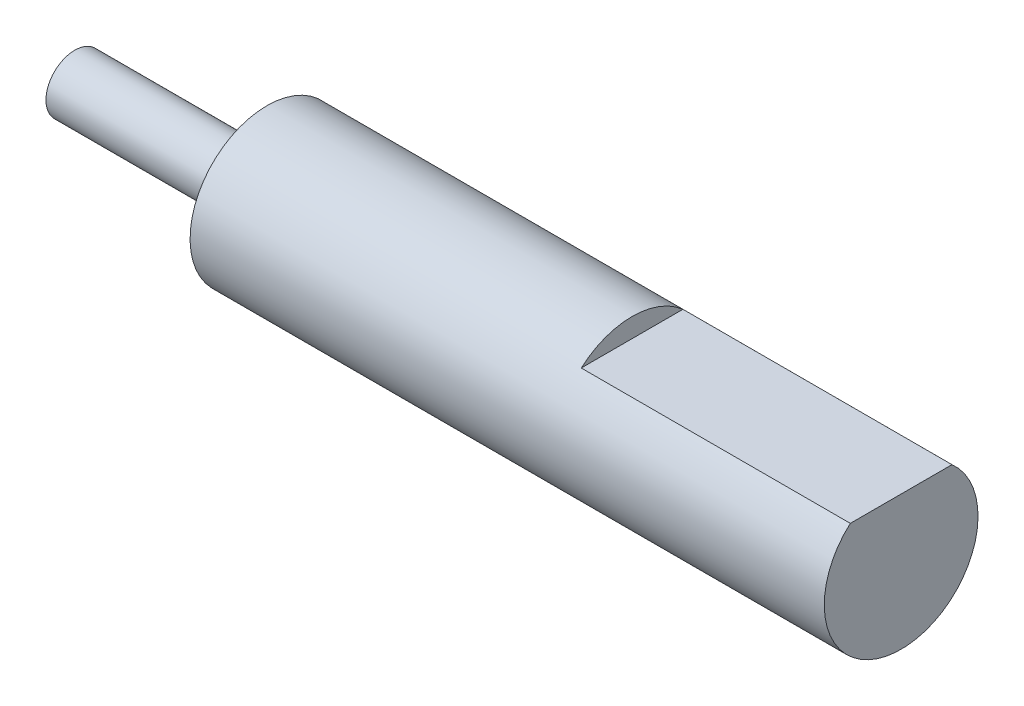
ISO-10303-21;
HEADER;
FILE_DESCRIPTION(('STEP AP214'),'2;1');
FILE_NAME('part.step','',(''),(''),'','','');
FILE_SCHEMA(('AUTOMOTIVE_DESIGN { 1 0 10303 214 1 1 1 1 }'));
ENDSEC;
DATA;
#1=APPLICATION_CONTEXT('core data for automotive mechanical design processes');
#2=APPLICATION_PROTOCOL_DEFINITION('international standard','automotive_design',2000,#1);
#3=PRODUCT_CONTEXT('',#1,'mechanical');
#4=PRODUCT('Part','Part','',(#3));
#5=PRODUCT_RELATED_PRODUCT_CATEGORY('part','',(#4));
#6=PRODUCT_DEFINITION_FORMATION('','',#4);
#7=PRODUCT_DEFINITION_CONTEXT('part definition',#1,'design');
#8=PRODUCT_DEFINITION('design','',#6,#7);
#9=PRODUCT_DEFINITION_SHAPE('','',#8);
#10=(LENGTH_UNIT() NAMED_UNIT(*) SI_UNIT(.MILLI.,.METRE.));
#11=(NAMED_UNIT(*) PLANE_ANGLE_UNIT() SI_UNIT($,.RADIAN.));
#12=(NAMED_UNIT(*) SI_UNIT($,.STERADIAN.) SOLID_ANGLE_UNIT());
#13=UNCERTAINTY_MEASURE_WITH_UNIT(LENGTH_MEASURE(1.E-05),#10,'distance_accuracy_value','');
#14=(GEOMETRIC_REPRESENTATION_CONTEXT(3) GLOBAL_UNCERTAINTY_ASSIGNED_CONTEXT((#13)) GLOBAL_UNIT_ASSIGNED_CONTEXT((#10,
#11,#12)) REPRESENTATION_CONTEXT('',''));
#15=CARTESIAN_POINT('',(0.,0.,0.));
#16=DIRECTION('',(0.,0.,1.));
#17=DIRECTION('',(1.,0.,0.));
#18=AXIS2_PLACEMENT_3D('',#15,#16,#17);
#19=CARTESIAN_POINT('',(-10.,0.,0.));
#20=DIRECTION('',(1.,0.,0.));
#21=DIRECTION('',(0.,0.,-1.));
#22=AXIS2_PLACEMENT_3D('',#19,#20,#21);
#23=CYLINDRICAL_SURFACE('',#22,1.5);
#24=CARTESIAN_POINT('',(-10.,0.,0.));
#25=DIRECTION('',(1.,0.,0.));
#26=DIRECTION('',(0.,0.,-1.));
#27=AXIS2_PLACEMENT_3D('',#24,#25,#26);
#28=CIRCLE('',#27,1.5);
#29=CARTESIAN_POINT('',(-10.,0.,-1.5));
#30=VERTEX_POINT('',#29);
#31=EDGE_CURVE('E11',#30,#30,#28,.T.);
#32=ORIENTED_EDGE('',*,*,#31,.T.);
#33=EDGE_LOOP('',(#32));
#34=FACE_BOUND('',#33,.T.);
#35=CARTESIAN_POINT('',(0.,0.,0.));
#36=DIRECTION('',(1.,0.,0.));
#37=DIRECTION('',(0.,0.,-1.));
#38=AXIS2_PLACEMENT_3D('',#35,#36,#37);
#39=CIRCLE('',#38,1.5);
#40=CARTESIAN_POINT('',(0.,0.,-1.5));
#41=VERTEX_POINT('',#40);
#42=EDGE_CURVE('E38',#41,#41,#39,.T.);
#43=ORIENTED_EDGE('',*,*,#42,.F.);
#44=EDGE_LOOP('',(#43));
#45=FACE_BOUND('',#44,.T.);
#46=ADVANCED_FACE('F35',(#34,#45),#23,.T.);
#47=CARTESIAN_POINT('',(-10.,0.,0.));
#48=DIRECTION('',(1.,0.,0.));
#49=DIRECTION('',(0.,0.,-1.));
#50=AXIS2_PLACEMENT_3D('',#47,#48,#49);
#51=PLANE('',#50);
#52=ORIENTED_EDGE('',*,*,#31,.F.);
#53=EDGE_LOOP('',(#52));
#54=FACE_BOUND('',#53,.T.);
#55=ADVANCED_FACE('F94',(#54),#51,.F.);
#56=CARTESIAN_POINT('',(33.,3.,0.));
#57=DIRECTION('',(0.,-1.,0.));
#58=DIRECTION('',(0.,0.,-1.));
#59=AXIS2_PLACEMENT_3D('',#56,#57,#58);
#60=PLANE('',#59);
#61=DIRECTION('',(-1.,0.,0.));
#62=VECTOR('',#61,1.);
#63=CARTESIAN_POINT('',(33.,3.,-2.64575131106459));
#64=LINE('',#63,#62);
#65=CARTESIAN_POINT('',(33.,3.,-2.64575131106459));
#66=VERTEX_POINT('',#65);
#67=CARTESIAN_POINT('',(19.,3.,-2.64575131106459));
#68=VERTEX_POINT('',#67);
#69=EDGE_CURVE('E54',#66,#68,#64,.T.);
#70=ORIENTED_EDGE('',*,*,#69,.T.);
#71=DIRECTION('',(0.,0.,1.));
#72=VECTOR('',#71,1.);
#73=CARTESIAN_POINT('',(19.,3.,0.));
#74=LINE('',#73,#72);
#75=CARTESIAN_POINT('',(19.,3.,2.64575131106459));
#76=VERTEX_POINT('',#75);
#77=EDGE_CURVE('E49',#68,#76,#74,.T.);
#78=ORIENTED_EDGE('',*,*,#77,.T.);
#79=DIRECTION('',(-1.,0.,0.));
#80=VECTOR('',#79,1.);
#81=CARTESIAN_POINT('',(33.,3.,2.64575131106459));
#82=LINE('',#81,#80);
#83=CARTESIAN_POINT('',(33.,3.,2.64575131106459));
#84=VERTEX_POINT('',#83);
#85=EDGE_CURVE('E65',#84,#76,#82,.T.);
#86=ORIENTED_EDGE('',*,*,#85,.F.);
#87=DIRECTION('',(0.,0.,1.));
#88=VECTOR('',#87,1.);
#89=CARTESIAN_POINT('',(33.,3.,0.));
#90=LINE('',#89,#88);
#91=EDGE_CURVE('E68',#66,#84,#90,.T.);
#92=ORIENTED_EDGE('',*,*,#91,.F.);
#93=EDGE_LOOP('',(#70,#78,#86,#92));
#94=FACE_BOUND('',#93,.T.);
#95=ADVANCED_FACE('F73',(#94),#60,.F.);
#96=CARTESIAN_POINT('',(33.,0.,0.));
#97=DIRECTION('',(-1.,0.,0.));
#98=DIRECTION('',(0.,0.,1.));
#99=AXIS2_PLACEMENT_3D('',#96,#97,#98);
#100=CYLINDRICAL_SURFACE('',#99,4.);
#101=CARTESIAN_POINT('',(0.,0.,0.));
#102=DIRECTION('',(1.,0.,0.));
#103=DIRECTION('',(0.,0.,-1.));
#104=AXIS2_PLACEMENT_3D('',#101,#102,#103);
#105=CIRCLE('',#104,4.);
#106=CARTESIAN_POINT('',(0.,0.,-4.));
#107=VERTEX_POINT('',#106);
#108=EDGE_CURVE('E71',#107,#107,#105,.T.);
#109=ORIENTED_EDGE('',*,*,#108,.T.);
#110=EDGE_LOOP('',(#109));
#111=FACE_BOUND('',#110,.T.);
#112=ORIENTED_EDGE('',*,*,#85,.T.);
#113=CARTESIAN_POINT('',(19.,0.,0.));
#114=DIRECTION('',(1.,0.,0.));
#115=DIRECTION('',(0.,0.,-1.));
#116=AXIS2_PLACEMENT_3D('',#113,#114,#115);
#117=CIRCLE('',#116,4.);
#118=EDGE_CURVE('E79',#68,#76,#117,.T.);
#119=ORIENTED_EDGE('',*,*,#118,.F.);
#120=ORIENTED_EDGE('',*,*,#69,.F.);
#121=CARTESIAN_POINT('',(33.,0.,0.));
#122=DIRECTION('',(1.,0.,0.));
#123=DIRECTION('',(0.,0.,-1.));
#124=AXIS2_PLACEMENT_3D('',#121,#122,#123);
#125=CIRCLE('',#124,4.);
#126=EDGE_CURVE('E62',#84,#66,#125,.T.);
#127=ORIENTED_EDGE('',*,*,#126,.F.);
#128=EDGE_LOOP('',(#112,#119,#120,#127));
#129=FACE_BOUND('',#128,.T.);
#130=ADVANCED_FACE('F64',(#111,#129),#100,.T.);
#131=CARTESIAN_POINT('',(33.,0.,0.));
#132=DIRECTION('',(1.,0.,0.));
#133=DIRECTION('',(0.,0.,-1.));
#134=AXIS2_PLACEMENT_3D('',#131,#132,#133);
#135=PLANE('',#134);
#136=ORIENTED_EDGE('',*,*,#91,.T.);
#137=ORIENTED_EDGE('',*,*,#126,.T.);
#138=EDGE_LOOP('',(#136,#137));
#139=FACE_BOUND('',#138,.T.);
#140=ADVANCED_FACE('F70',(#139),#135,.T.);
#141=CARTESIAN_POINT('',(0.,0.,0.));
#142=DIRECTION('',(1.,0.,0.));
#143=DIRECTION('',(0.,0.,-1.));
#144=AXIS2_PLACEMENT_3D('',#141,#142,#143);
#145=PLANE('',#144);
#146=ORIENTED_EDGE('',*,*,#42,.T.);
#147=EDGE_LOOP('',(#146));
#148=FACE_BOUND('',#147,.T.);
#149=ORIENTED_EDGE('',*,*,#108,.F.);
#150=EDGE_LOOP('',(#149));
#151=FACE_BOUND('',#150,.T.);
#152=ADVANCED_FACE('F85',(#148,#151),#145,.F.);
#153=CARTESIAN_POINT('',(19.,0.,0.));
#154=DIRECTION('',(1.,0.,0.));
#155=DIRECTION('',(0.,0.,-1.));
#156=AXIS2_PLACEMENT_3D('',#153,#154,#155);
#157=PLANE('',#156);
#158=ORIENTED_EDGE('',*,*,#77,.F.);
#159=ORIENTED_EDGE('',*,*,#118,.T.);
#160=EDGE_LOOP('',(#158,#159));
#161=FACE_BOUND('',#160,.T.);
#162=ADVANCED_FACE('F83',(#161),#157,.T.);
#163=CLOSED_SHELL('',(#46,#55,#95,#130,#140,#152,#162));
#164=MANIFOLD_SOLID_BREP('B2',#163);
#165=ADVANCED_BREP_SHAPE_REPRESENTATION('',(#18,#164),#14);
#166=SHAPE_DEFINITION_REPRESENTATION(#9,#165);
ENDSEC;
END-ISO-10303-21;
